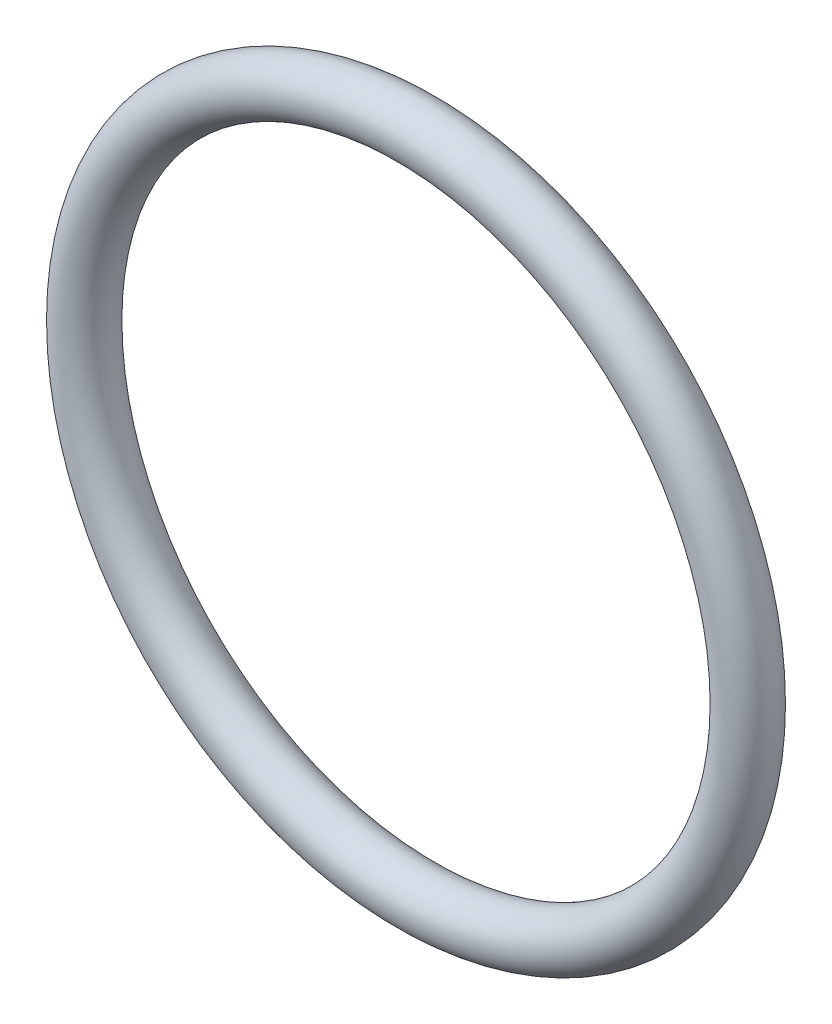
ISO-10303-21;
HEADER;
FILE_DESCRIPTION(('STEP AP214'),'2;1');
FILE_NAME('part.step','',(''),(''),'','','');
FILE_SCHEMA(('AUTOMOTIVE_DESIGN { 1 0 10303 214 1 1 1 1 }'));
ENDSEC;
DATA;
#1=APPLICATION_CONTEXT('core data for automotive mechanical design processes');
#2=APPLICATION_PROTOCOL_DEFINITION('international standard','automotive_design',2000,#1);
#3=PRODUCT_CONTEXT('',#1,'mechanical');
#4=PRODUCT('Part','Part','',(#3));
#5=PRODUCT_RELATED_PRODUCT_CATEGORY('part','',(#4));
#6=PRODUCT_DEFINITION_FORMATION('','',#4);
#7=PRODUCT_DEFINITION_CONTEXT('part definition',#1,'design');
#8=PRODUCT_DEFINITION('design','',#6,#7);
#9=PRODUCT_DEFINITION_SHAPE('','',#8);
#10=(LENGTH_UNIT() NAMED_UNIT(*) SI_UNIT(.MILLI.,.METRE.));
#11=(NAMED_UNIT(*) PLANE_ANGLE_UNIT() SI_UNIT($,.RADIAN.));
#12=(NAMED_UNIT(*) SI_UNIT($,.STERADIAN.) SOLID_ANGLE_UNIT());
#13=UNCERTAINTY_MEASURE_WITH_UNIT(LENGTH_MEASURE(1.E-05),#10,'distance_accuracy_value','');
#14=(GEOMETRIC_REPRESENTATION_CONTEXT(3) GLOBAL_UNCERTAINTY_ASSIGNED_CONTEXT((#13)) GLOBAL_UNIT_ASSIGNED_CONTEXT((#10,
#11,#12)) REPRESENTATION_CONTEXT('',''));
#15=CARTESIAN_POINT('',(0.,0.,0.));
#16=DIRECTION('',(0.,0.,1.));
#17=DIRECTION('',(1.,0.,0.));
#18=AXIS2_PLACEMENT_3D('',#15,#16,#17);
#19=CARTESIAN_POINT('',(0.,0.,0.));
#20=DIRECTION('',(0.,0.,1.));
#21=DIRECTION('',(1.,0.,0.));
#22=AXIS2_PLACEMENT_3D('',#19,#20,#21);
#23=TOROIDAL_SURFACE('',#22,11.0617,0.888999999999998);
#24=CARTESIAN_POINT('',(11.9507,0.,0.));
#25=VERTEX_POINT('',#24);
#26=VERTEX_LOOP('',#25);
#27=FACE_BOUND('',#26,.T.);
#28=ADVANCED_FACE('F31',(#27),#23,.T.);
#29=CLOSED_SHELL('',(#28));
#30=MANIFOLD_SOLID_BREP('B2',#29);
#31=ADVANCED_BREP_SHAPE_REPRESENTATION('',(#18,#30),#14);
#32=SHAPE_DEFINITION_REPRESENTATION(#9,#31);
ENDSEC;
END-ISO-10303-21;
